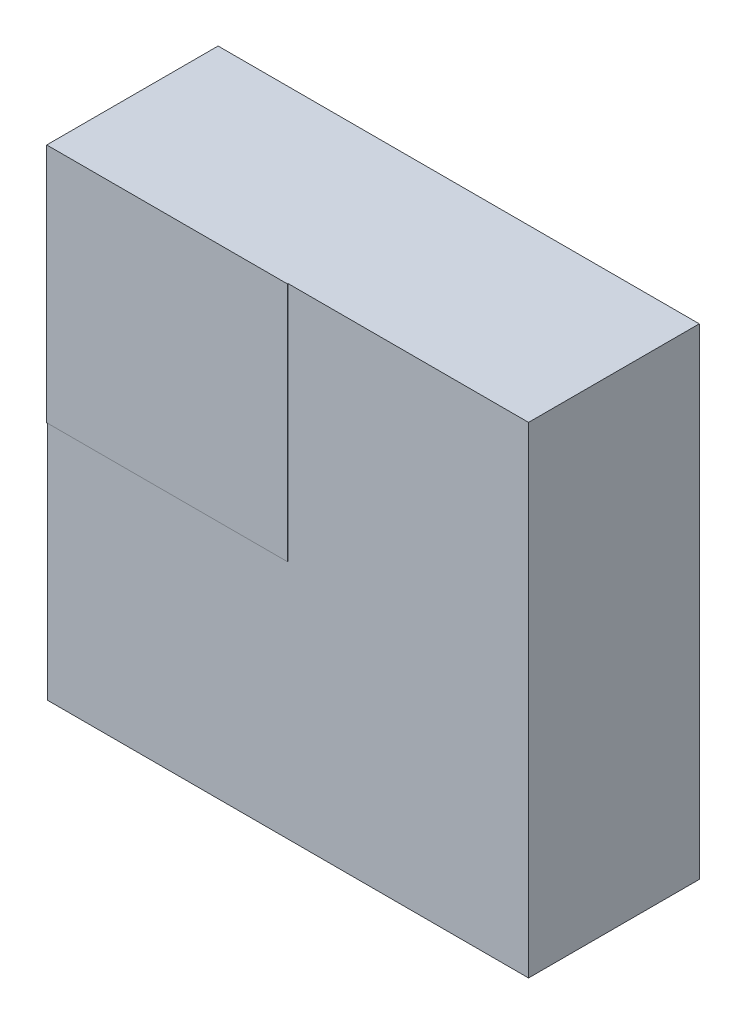
ISO-10303-21;
HEADER;
FILE_DESCRIPTION(('STEP AP214'),'2;1');
FILE_NAME('part.step','',(''),(''),'','','');
FILE_SCHEMA(('AUTOMOTIVE_DESIGN { 1 0 10303 214 1 1 1 1 }'));
ENDSEC;
DATA;
#1=APPLICATION_CONTEXT('core data for automotive mechanical design processes');
#2=APPLICATION_PROTOCOL_DEFINITION('international standard','automotive_design',2000,#1);
#3=PRODUCT_CONTEXT('',#1,'mechanical');
#4=PRODUCT('Part','Part','',(#3));
#5=PRODUCT_RELATED_PRODUCT_CATEGORY('part','',(#4));
#6=PRODUCT_DEFINITION_FORMATION('','',#4);
#7=PRODUCT_DEFINITION_CONTEXT('part definition',#1,'design');
#8=PRODUCT_DEFINITION('design','',#6,#7);
#9=PRODUCT_DEFINITION_SHAPE('','',#8);
#10=(LENGTH_UNIT() NAMED_UNIT(*) SI_UNIT(.MILLI.,.METRE.));
#11=(NAMED_UNIT(*) PLANE_ANGLE_UNIT() SI_UNIT($,.RADIAN.));
#12=(NAMED_UNIT(*) SI_UNIT($,.STERADIAN.) SOLID_ANGLE_UNIT());
#13=UNCERTAINTY_MEASURE_WITH_UNIT(LENGTH_MEASURE(1.E-05),#10,'distance_accuracy_value','');
#14=(GEOMETRIC_REPRESENTATION_CONTEXT(3) GLOBAL_UNCERTAINTY_ASSIGNED_CONTEXT((#13)) GLOBAL_UNIT_ASSIGNED_CONTEXT((#10,
#11,#12)) REPRESENTATION_CONTEXT('',''));
#15=CARTESIAN_POINT('',(0.,0.,0.));
#16=DIRECTION('',(0.,0.,1.));
#17=DIRECTION('',(1.,0.,0.));
#18=AXIS2_PLACEMENT_3D('',#15,#16,#17);
#19=CARTESIAN_POINT('',(0.,0.,0.4));
#20=DIRECTION('',(0.,0.,-1.));
#21=DIRECTION('',(-1.,0.,0.));
#22=AXIS2_PLACEMENT_3D('',#19,#20,#21);
#23=PLANE('',#22);
#24=DIRECTION('',(0.,1.,0.));
#25=VECTOR('',#24,1.);
#26=CARTESIAN_POINT('',(0.,0.3805,0.4));
#27=LINE('',#26,#25);
#28=CARTESIAN_POINT('',(0.,0.,0.4));
#29=VERTEX_POINT('',#28);
#30=CARTESIAN_POINT('',(0.,0.3805,0.4));
#31=VERTEX_POINT('',#30);
#32=EDGE_CURVE('E116',#29,#31,#27,.T.);
#33=ORIENTED_EDGE('',*,*,#32,.F.);
#34=DIRECTION('',(1.,0.,0.));
#35=VECTOR('',#34,1.);
#36=CARTESIAN_POINT('',(-0.3805,0.,0.4));
#37=LINE('',#36,#35);
#38=CARTESIAN_POINT('',(-0.3805,0.,0.4));
#39=VERTEX_POINT('',#38);
#40=EDGE_CURVE('E54',#39,#29,#37,.T.);
#41=ORIENTED_EDGE('',*,*,#40,.F.);
#42=DIRECTION('',(0.,-1.,0.));
#43=VECTOR('',#42,1.);
#44=CARTESIAN_POINT('',(-0.3805,-0.3805,0.4));
#45=LINE('',#44,#43);
#46=CARTESIAN_POINT('',(-0.3805,-0.3805,0.4));
#47=VERTEX_POINT('',#46);
#48=EDGE_CURVE('E120',#39,#47,#45,.T.);
#49=ORIENTED_EDGE('',*,*,#48,.T.);
#50=DIRECTION('',(1.,0.,0.));
#51=VECTOR('',#50,1.);
#52=CARTESIAN_POINT('',(-0.3805,-0.3805,0.4));
#53=LINE('',#52,#51);
#54=CARTESIAN_POINT('',(0.3805,-0.3805,0.4));
#55=VERTEX_POINT('',#54);
#56=EDGE_CURVE('E135',#47,#55,#53,.T.);
#57=ORIENTED_EDGE('',*,*,#56,.T.);
#58=DIRECTION('',(0.,1.,0.));
#59=VECTOR('',#58,1.);
#60=CARTESIAN_POINT('',(0.3805,-0.3805,0.4));
#61=LINE('',#60,#59);
#62=CARTESIAN_POINT('',(0.3805,0.3805,0.4));
#63=VERTEX_POINT('',#62);
#64=EDGE_CURVE('E130',#55,#63,#61,.T.);
#65=ORIENTED_EDGE('',*,*,#64,.T.);
#66=DIRECTION('',(-1.,0.,0.));
#67=VECTOR('',#66,1.);
#68=CARTESIAN_POINT('',(-0.3805,0.3805,0.4));
#69=LINE('',#68,#67);
#70=EDGE_CURVE('E60',#63,#31,#69,.T.);
#71=ORIENTED_EDGE('',*,*,#70,.T.);
#72=EDGE_LOOP('',(#33,#41,#49,#57,#65,#71));
#73=FACE_BOUND('',#72,.T.);
#74=ADVANCED_FACE('F39',(#73),#23,.F.);
#75=CARTESIAN_POINT('',(0.3805,-0.3805,0.4));
#76=DIRECTION('',(-1.,0.,0.));
#77=DIRECTION('',(0.,0.,1.));
#78=AXIS2_PLACEMENT_3D('',#75,#76,#77);
#79=PLANE('',#78);
#80=DIRECTION('',(0.,1.,0.));
#81=VECTOR('',#80,1.);
#82=CARTESIAN_POINT('',(0.3805,-0.3805,0.13));
#83=LINE('',#82,#81);
#84=CARTESIAN_POINT('',(0.3805,-0.3805,0.13));
#85=VERTEX_POINT('',#84);
#86=CARTESIAN_POINT('',(0.3805,0.3805,0.13));
#87=VERTEX_POINT('',#86);
#88=EDGE_CURVE('E121',#85,#87,#83,.T.);
#89=ORIENTED_EDGE('',*,*,#88,.T.);
#90=DIRECTION('',(0.,0.,-1.));
#91=VECTOR('',#90,1.);
#92=CARTESIAN_POINT('',(0.3805,0.3805,0.4));
#93=LINE('',#92,#91);
#94=EDGE_CURVE('E149',#63,#87,#93,.T.);
#95=ORIENTED_EDGE('',*,*,#94,.F.);
#96=ORIENTED_EDGE('',*,*,#64,.F.);
#97=DIRECTION('',(0.,0.,-1.));
#98=VECTOR('',#97,1.);
#99=CARTESIAN_POINT('',(0.3805,-0.3805,0.4));
#100=LINE('',#99,#98);
#101=EDGE_CURVE('E136',#55,#85,#100,.T.);
#102=ORIENTED_EDGE('',*,*,#101,.T.);
#103=EDGE_LOOP('',(#89,#95,#96,#102));
#104=FACE_BOUND('',#103,.T.);
#105=ADVANCED_FACE('F41',(#104),#79,.F.);
#106=CARTESIAN_POINT('',(-0.3805,0.3805,0.4));
#107=DIRECTION('',(0.,-1.,0.));
#108=DIRECTION('',(0.,0.,-1.));
#109=AXIS2_PLACEMENT_3D('',#106,#107,#108);
#110=PLANE('',#109);
#111=DIRECTION('',(-1.,0.,0.));
#112=VECTOR('',#111,1.);
#113=CARTESIAN_POINT('',(-0.3805,0.3805,0.13));
#114=LINE('',#113,#112);
#115=CARTESIAN_POINT('',(-0.3805,0.3805,0.13));
#116=VERTEX_POINT('',#115);
#117=EDGE_CURVE('E124',#87,#116,#114,.T.);
#118=ORIENTED_EDGE('',*,*,#117,.T.);
#119=DIRECTION('',(0.,0.,-1.));
#120=VECTOR('',#119,1.);
#121=CARTESIAN_POINT('',(-0.3805,0.3805,0.4));
#122=LINE('',#121,#120);
#123=CARTESIAN_POINT('',(-0.3805,0.3805,0.401));
#124=VERTEX_POINT('',#123);
#125=EDGE_CURVE('E147',#124,#116,#122,.T.);
#126=ORIENTED_EDGE('',*,*,#125,.F.);
#127=DIRECTION('',(-1.,0.,0.));
#128=VECTOR('',#127,1.);
#129=CARTESIAN_POINT('',(-0.3805,0.3805,0.401));
#130=LINE('',#129,#128);
#131=CARTESIAN_POINT('',(0.,0.3805,0.401));
#132=VERTEX_POINT('',#131);
#133=EDGE_CURVE('E113',#132,#124,#130,.T.);
#134=ORIENTED_EDGE('',*,*,#133,.F.);
#135=DIRECTION('',(0.,0.,-1.));
#136=VECTOR('',#135,1.);
#137=CARTESIAN_POINT('',(0.,0.3805,0.401));
#138=LINE('',#137,#136);
#139=EDGE_CURVE('E126',#132,#31,#138,.T.);
#140=ORIENTED_EDGE('',*,*,#139,.T.);
#141=ORIENTED_EDGE('',*,*,#70,.F.);
#142=ORIENTED_EDGE('',*,*,#94,.T.);
#143=EDGE_LOOP('',(#118,#126,#134,#140,#141,#142));
#144=FACE_BOUND('',#143,.T.);
#145=ADVANCED_FACE('F182',(#144),#110,.F.);
#146=CARTESIAN_POINT('',(-0.3805,-0.3805,0.4));
#147=DIRECTION('',(1.,0.,0.));
#148=DIRECTION('',(0.,0.,-1.));
#149=AXIS2_PLACEMENT_3D('',#146,#147,#148);
#150=PLANE('',#149);
#151=DIRECTION('',(0.,-1.,0.));
#152=VECTOR('',#151,1.);
#153=CARTESIAN_POINT('',(-0.3805,-0.3805,0.13));
#154=LINE('',#153,#152);
#155=CARTESIAN_POINT('',(-0.3805,-0.3805,0.13));
#156=VERTEX_POINT('',#155);
#157=EDGE_CURVE('E139',#116,#156,#154,.T.);
#158=ORIENTED_EDGE('',*,*,#157,.T.);
#159=DIRECTION('',(0.,0.,-1.));
#160=VECTOR('',#159,1.);
#161=CARTESIAN_POINT('',(-0.3805,-0.3805,0.4));
#162=LINE('',#161,#160);
#163=EDGE_CURVE('E144',#47,#156,#162,.T.);
#164=ORIENTED_EDGE('',*,*,#163,.F.);
#165=ORIENTED_EDGE('',*,*,#48,.F.);
#166=DIRECTION('',(0.,0.,-1.));
#167=VECTOR('',#166,1.);
#168=CARTESIAN_POINT('',(-0.3805,0.,0.401));
#169=LINE('',#168,#167);
#170=CARTESIAN_POINT('',(-0.3805,0.,0.401));
#171=VERTEX_POINT('',#170);
#172=EDGE_CURVE('E101',#171,#39,#169,.T.);
#173=ORIENTED_EDGE('',*,*,#172,.F.);
#174=DIRECTION('',(0.,-1.,0.));
#175=VECTOR('',#174,1.);
#176=CARTESIAN_POINT('',(-0.3805,0.3805,0.401));
#177=LINE('',#176,#175);
#178=EDGE_CURVE('E107',#124,#171,#177,.T.);
#179=ORIENTED_EDGE('',*,*,#178,.F.);
#180=ORIENTED_EDGE('',*,*,#125,.T.);
#181=EDGE_LOOP('',(#158,#164,#165,#173,#179,#180));
#182=FACE_BOUND('',#181,.T.);
#183=ADVANCED_FACE('F118',(#182),#150,.F.);
#184=CARTESIAN_POINT('',(-0.3805,-0.3805,0.4));
#185=DIRECTION('',(0.,1.,0.));
#186=DIRECTION('',(0.,0.,1.));
#187=AXIS2_PLACEMENT_3D('',#184,#185,#186);
#188=PLANE('',#187);
#189=DIRECTION('',(1.,0.,0.));
#190=VECTOR('',#189,1.);
#191=CARTESIAN_POINT('',(-0.3805,-0.3805,0.13));
#192=LINE('',#191,#190);
#193=EDGE_CURVE('E132',#156,#85,#192,.T.);
#194=ORIENTED_EDGE('',*,*,#193,.T.);
#195=ORIENTED_EDGE('',*,*,#101,.F.);
#196=ORIENTED_EDGE('',*,*,#56,.F.);
#197=ORIENTED_EDGE('',*,*,#163,.T.);
#198=EDGE_LOOP('',(#194,#195,#196,#197));
#199=FACE_BOUND('',#198,.T.);
#200=ADVANCED_FACE('F165',(#199),#188,.F.);
#201=CARTESIAN_POINT('',(0.,0.,0.13));
#202=DIRECTION('',(0.,0.,-1.));
#203=DIRECTION('',(-1.,0.,0.));
#204=AXIS2_PLACEMENT_3D('',#201,#202,#203);
#205=PLANE('',#204);
#206=CARTESIAN_POINT('',(-0.2,-0.2,0.13));
#207=DIRECTION('',(0.,0.,-1.));
#208=DIRECTION('',(-1.,0.,0.));
#209=AXIS2_PLACEMENT_3D('',#206,#207,#208);
#210=CIRCLE('',#209,0.0953939201416946);
#211=CARTESIAN_POINT('',(-0.295393920141695,-0.2,0.13));
#212=VERTEX_POINT('',#211);
#213=EDGE_CURVE('E11',#212,#212,#210,.T.);
#214=ORIENTED_EDGE('',*,*,#213,.F.);
#215=EDGE_LOOP('',(#214));
#216=FACE_BOUND('',#215,.T.);
#217=CARTESIAN_POINT('',(-0.2,0.2,0.13));
#218=DIRECTION('',(0.,0.,-1.));
#219=DIRECTION('',(-1.,0.,0.));
#220=AXIS2_PLACEMENT_3D('',#217,#218,#219);
#221=CIRCLE('',#220,0.0953939201416946);
#222=CARTESIAN_POINT('',(-0.295393920141695,0.2,0.13));
#223=VERTEX_POINT('',#222);
#224=EDGE_CURVE('E47',#223,#223,#221,.T.);
#225=ORIENTED_EDGE('',*,*,#224,.F.);
#226=EDGE_LOOP('',(#225));
#227=FACE_BOUND('',#226,.T.);
#228=CARTESIAN_POINT('',(0.2,-0.2,0.13));
#229=DIRECTION('',(0.,0.,-1.));
#230=DIRECTION('',(-1.,0.,0.));
#231=AXIS2_PLACEMENT_3D('',#228,#229,#230);
#232=CIRCLE('',#231,0.0953939201416946);
#233=CARTESIAN_POINT('',(0.104606079858305,-0.2,0.13));
#234=VERTEX_POINT('',#233);
#235=EDGE_CURVE('E155',#234,#234,#232,.T.);
#236=ORIENTED_EDGE('',*,*,#235,.F.);
#237=EDGE_LOOP('',(#236));
#238=FACE_BOUND('',#237,.T.);
#239=CARTESIAN_POINT('',(0.2,0.2,0.13));
#240=DIRECTION('',(0.,0.,-1.));
#241=DIRECTION('',(-1.,0.,0.));
#242=AXIS2_PLACEMENT_3D('',#239,#240,#241);
#243=CIRCLE('',#242,0.0953939201416946);
#244=CARTESIAN_POINT('',(0.104606079858305,0.2,0.13));
#245=VERTEX_POINT('',#244);
#246=EDGE_CURVE('E152',#245,#245,#243,.T.);
#247=ORIENTED_EDGE('',*,*,#246,.F.);
#248=EDGE_LOOP('',(#247));
#249=FACE_BOUND('',#248,.T.);
#250=ORIENTED_EDGE('',*,*,#88,.F.);
#251=ORIENTED_EDGE('',*,*,#193,.F.);
#252=ORIENTED_EDGE('',*,*,#157,.F.);
#253=ORIENTED_EDGE('',*,*,#117,.F.);
#254=EDGE_LOOP('',(#250,#251,#252,#253));
#255=FACE_BOUND('',#254,.T.);
#256=ADVANCED_FACE('F162',(#216,#227,#238,#249,#255),#205,.T.);
#257=CARTESIAN_POINT('',(-0.3805,0.,0.401));
#258=DIRECTION('',(0.,1.,0.));
#259=DIRECTION('',(0.,0.,1.));
#260=AXIS2_PLACEMENT_3D('',#257,#258,#259);
#261=PLANE('',#260);
#262=ORIENTED_EDGE('',*,*,#40,.T.);
#263=DIRECTION('',(0.,0.,-1.));
#264=VECTOR('',#263,1.);
#265=CARTESIAN_POINT('',(0.,0.,0.401));
#266=LINE('',#265,#264);
#267=CARTESIAN_POINT('',(0.,0.,0.401));
#268=VERTEX_POINT('',#267);
#269=EDGE_CURVE('E103',#268,#29,#266,.T.);
#270=ORIENTED_EDGE('',*,*,#269,.F.);
#271=DIRECTION('',(1.,0.,0.));
#272=VECTOR('',#271,1.);
#273=CARTESIAN_POINT('',(-0.3805,0.,0.401));
#274=LINE('',#273,#272);
#275=EDGE_CURVE('E97',#171,#268,#274,.T.);
#276=ORIENTED_EDGE('',*,*,#275,.F.);
#277=ORIENTED_EDGE('',*,*,#172,.T.);
#278=EDGE_LOOP('',(#262,#270,#276,#277));
#279=FACE_BOUND('',#278,.T.);
#280=ADVANCED_FACE('F99',(#279),#261,.F.);
#281=CARTESIAN_POINT('',(0.,0.3805,0.401));
#282=DIRECTION('',(-1.,0.,0.));
#283=DIRECTION('',(0.,0.,1.));
#284=AXIS2_PLACEMENT_3D('',#281,#282,#283);
#285=PLANE('',#284);
#286=ORIENTED_EDGE('',*,*,#32,.T.);
#287=ORIENTED_EDGE('',*,*,#139,.F.);
#288=DIRECTION('',(0.,1.,0.));
#289=VECTOR('',#288,1.);
#290=CARTESIAN_POINT('',(0.,0.3805,0.401));
#291=LINE('',#290,#289);
#292=EDGE_CURVE('E106',#268,#132,#291,.T.);
#293=ORIENTED_EDGE('',*,*,#292,.F.);
#294=ORIENTED_EDGE('',*,*,#269,.T.);
#295=EDGE_LOOP('',(#286,#287,#293,#294));
#296=FACE_BOUND('',#295,.T.);
#297=ADVANCED_FACE('F221',(#296),#285,.F.);
#298=CARTESIAN_POINT('',(0.,0.,0.401));
#299=DIRECTION('',(0.,0.,1.));
#300=DIRECTION('',(1.,0.,0.));
#301=AXIS2_PLACEMENT_3D('',#298,#299,#300);
#302=PLANE('',#301);
#303=ORIENTED_EDGE('',*,*,#178,.T.);
#304=ORIENTED_EDGE('',*,*,#275,.T.);
#305=ORIENTED_EDGE('',*,*,#292,.T.);
#306=ORIENTED_EDGE('',*,*,#133,.T.);
#307=EDGE_LOOP('',(#303,#304,#305,#306));
#308=FACE_BOUND('',#307,.T.);
#309=ADVANCED_FACE('F111',(#308),#302,.T.);
#310=CARTESIAN_POINT('',(0.2,0.2,0.1));
#311=DIRECTION('',(0.,0.,1.));
#312=DIRECTION('',(1.,0.,0.));
#313=AXIS2_PLACEMENT_3D('',#310,#311,#312);
#314=SPHERICAL_SURFACE('',#313,0.1);
#315=ORIENTED_EDGE('',*,*,#246,.T.);
#316=EDGE_LOOP('',(#315));
#317=FACE_BOUND('',#316,.T.);
#318=ADVANCED_FACE('F234',(#317),#314,.T.);
#319=CARTESIAN_POINT('',(0.2,-0.2,0.1));
#320=DIRECTION('',(0.,0.,1.));
#321=DIRECTION('',(1.,0.,0.));
#322=AXIS2_PLACEMENT_3D('',#319,#320,#321);
#323=SPHERICAL_SURFACE('',#322,0.1);
#324=ORIENTED_EDGE('',*,*,#235,.T.);
#325=EDGE_LOOP('',(#324));
#326=FACE_BOUND('',#325,.T.);
#327=ADVANCED_FACE('F239',(#326),#323,.T.);
#328=CARTESIAN_POINT('',(-0.2,0.2,0.1));
#329=DIRECTION('',(0.,0.,1.));
#330=DIRECTION('',(1.,0.,0.));
#331=AXIS2_PLACEMENT_3D('',#328,#329,#330);
#332=SPHERICAL_SURFACE('',#331,0.1);
#333=ORIENTED_EDGE('',*,*,#224,.T.);
#334=EDGE_LOOP('',(#333));
#335=FACE_BOUND('',#334,.T.);
#336=ADVANCED_FACE('F160',(#335),#332,.T.);
#337=CARTESIAN_POINT('',(-0.2,-0.2,0.1));
#338=DIRECTION('',(0.,0.,1.));
#339=DIRECTION('',(1.,0.,0.));
#340=AXIS2_PLACEMENT_3D('',#337,#338,#339);
#341=SPHERICAL_SURFACE('',#340,0.1);
#342=ORIENTED_EDGE('',*,*,#213,.T.);
#343=EDGE_LOOP('',(#342));
#344=FACE_BOUND('',#343,.T.);
#345=ADVANCED_FACE('F253',(#344),#341,.T.);
#346=CLOSED_SHELL('',(#74,#105,#145,#183,#200,#256,#280,#297,#309,#318,#327,#336,#345));
#347=MANIFOLD_SOLID_BREP('B2',#346);
#348=ADVANCED_BREP_SHAPE_REPRESENTATION('',(#18,#347),#14);
#349=SHAPE_DEFINITION_REPRESENTATION(#9,#348);
ENDSEC;
END-ISO-10303-21;
